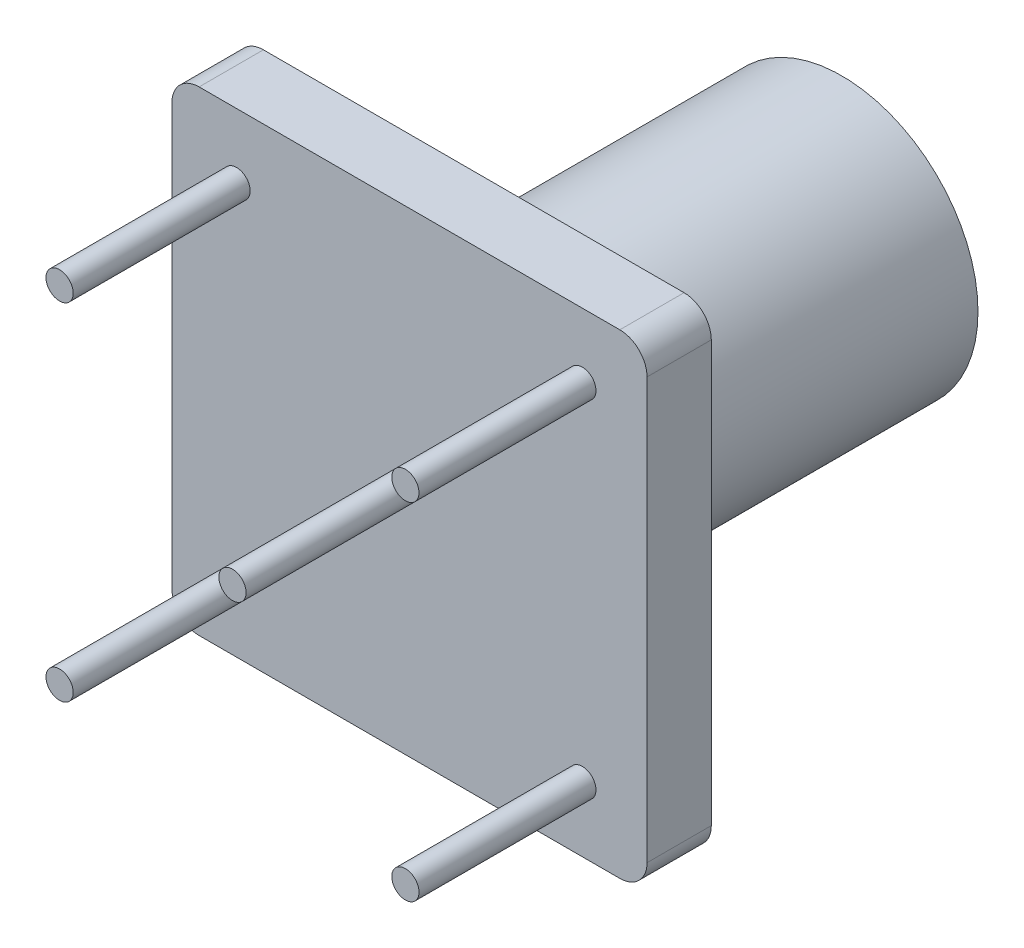
ISO-10303-21;
HEADER;
FILE_DESCRIPTION(('STEP AP214'),'2;1');
FILE_NAME('part.step','',(''),(''),'','','');
FILE_SCHEMA(('AUTOMOTIVE_DESIGN { 1 0 10303 214 1 1 1 1 }'));
ENDSEC;
DATA;
#1=APPLICATION_CONTEXT('core data for automotive mechanical design processes');
#2=APPLICATION_PROTOCOL_DEFINITION('international standard','automotive_design',2000,#1);
#3=PRODUCT_CONTEXT('',#1,'mechanical');
#4=PRODUCT('Part','Part','',(#3));
#5=PRODUCT_RELATED_PRODUCT_CATEGORY('part','',(#4));
#6=PRODUCT_DEFINITION_FORMATION('','',#4);
#7=PRODUCT_DEFINITION_CONTEXT('part definition',#1,'design');
#8=PRODUCT_DEFINITION('design','',#6,#7);
#9=PRODUCT_DEFINITION_SHAPE('','',#8);
#10=(LENGTH_UNIT() NAMED_UNIT(*) SI_UNIT(.MILLI.,.METRE.));
#11=(NAMED_UNIT(*) PLANE_ANGLE_UNIT() SI_UNIT($,.RADIAN.));
#12=(NAMED_UNIT(*) SI_UNIT($,.STERADIAN.) SOLID_ANGLE_UNIT());
#13=UNCERTAINTY_MEASURE_WITH_UNIT(LENGTH_MEASURE(1.E-05),#10,'distance_accuracy_value','');
#14=(GEOMETRIC_REPRESENTATION_CONTEXT(3) GLOBAL_UNCERTAINTY_ASSIGNED_CONTEXT((#13)) GLOBAL_UNIT_ASSIGNED_CONTEXT((#10,
#11,#12)) REPRESENTATION_CONTEXT('',''));
#15=CARTESIAN_POINT('',(0.,0.,0.));
#16=DIRECTION('',(0.,0.,1.));
#17=DIRECTION('',(1.,0.,0.));
#18=AXIS2_PLACEMENT_3D('',#15,#16,#17);
#19=CARTESIAN_POINT('',(8.725,-8.725,0.));
#20=DIRECTION('',(0.,0.,-1.));
#21=DIRECTION('',(-1.,0.,0.));
#22=AXIS2_PLACEMENT_3D('',#19,#20,#21);
#23=PLANE('',#22);
#24=CARTESIAN_POINT('',(8.725,-8.725,0.));
#25=DIRECTION('',(0.,0.,-1.));
#26=DIRECTION('',(-1.,0.,0.));
#27=AXIS2_PLACEMENT_3D('',#24,#25,#26);
#28=CIRCLE('',#27,4.5);
#29=CARTESIAN_POINT('',(4.225,-8.725,0.));
#30=VERTEX_POINT('',#29);
#31=EDGE_CURVE('E118',#30,#30,#28,.T.);
#32=ORIENTED_EDGE('',*,*,#31,.T.);
#33=EDGE_LOOP('',(#32));
#34=FACE_BOUND('',#33,.T.);
#35=CARTESIAN_POINT('',(8.725,-8.725,0.));
#36=DIRECTION('',(0.,0.,-1.));
#37=DIRECTION('',(-1.,0.,0.));
#38=AXIS2_PLACEMENT_3D('',#35,#36,#37);
#39=CIRCLE('',#38,0.500000000000001);
#40=CARTESIAN_POINT('',(8.225,-8.725,0.));
#41=VERTEX_POINT('',#40);
#42=EDGE_CURVE('E405',#41,#41,#39,.T.);
#43=ORIENTED_EDGE('',*,*,#42,.F.);
#44=EDGE_LOOP('',(#43));
#45=FACE_BOUND('',#44,.T.);
#46=ADVANCED_FACE('F29',(#34,#45),#23,.T.);
#47=CARTESIAN_POINT('',(16.45,-1.,2.36));
#48=DIRECTION('',(0.,0.,1.));
#49=DIRECTION('',(1.,0.,0.));
#50=AXIS2_PLACEMENT_3D('',#47,#48,#49);
#51=PLANE('',#50);
#52=CARTESIAN_POINT('',(2.375,-15.075,2.36));
#53=DIRECTION('',(0.,0.,1.));
#54=DIRECTION('',(1.,0.,0.));
#55=AXIS2_PLACEMENT_3D('',#52,#53,#54);
#56=CIRCLE('',#55,0.5);
#57=CARTESIAN_POINT('',(2.875,-15.075,2.36));
#58=VERTEX_POINT('',#57);
#59=EDGE_CURVE('E415',#58,#58,#56,.T.);
#60=ORIENTED_EDGE('',*,*,#59,.F.);
#61=EDGE_LOOP('',(#60));
#62=FACE_BOUND('',#61,.T.);
#63=CARTESIAN_POINT('',(15.075,-2.375,2.36));
#64=DIRECTION('',(0.,0.,1.));
#65=DIRECTION('',(1.,0.,0.));
#66=AXIS2_PLACEMENT_3D('',#63,#64,#65);
#67=CIRCLE('',#66,0.499999999999997);
#68=CARTESIAN_POINT('',(15.575,-2.375,2.36));
#69=VERTEX_POINT('',#68);
#70=EDGE_CURVE('E427',#69,#69,#67,.T.);
#71=ORIENTED_EDGE('',*,*,#70,.F.);
#72=EDGE_LOOP('',(#71));
#73=FACE_BOUND('',#72,.T.);
#74=CARTESIAN_POINT('',(16.45,-1.,2.36));
#75=DIRECTION('',(0.,0.,1.));
#76=DIRECTION('',(1.,0.,0.));
#77=AXIS2_PLACEMENT_3D('',#74,#75,#76);
#78=CIRCLE('',#77,1.);
#79=CARTESIAN_POINT('',(17.45,-1.00000000000001,2.36));
#80=VERTEX_POINT('',#79);
#81=CARTESIAN_POINT('',(16.45,0.,2.36));
#82=VERTEX_POINT('',#81);
#83=EDGE_CURVE('E133',#80,#82,#78,.T.);
#84=ORIENTED_EDGE('',*,*,#83,.T.);
#85=DIRECTION('',(-1.,0.,0.));
#86=VECTOR('',#85,1.);
#87=CARTESIAN_POINT('',(1.00000000000001,0.,2.36));
#88=LINE('',#87,#86);
#89=CARTESIAN_POINT('',(1.00000000000001,0.,2.36));
#90=VERTEX_POINT('',#89);
#91=EDGE_CURVE('E109',#82,#90,#88,.T.);
#92=ORIENTED_EDGE('',*,*,#91,.T.);
#93=CARTESIAN_POINT('',(1.,-1.,2.36));
#94=DIRECTION('',(0.,0.,1.));
#95=DIRECTION('',(1.,0.,0.));
#96=AXIS2_PLACEMENT_3D('',#93,#94,#95);
#97=CIRCLE('',#96,1.);
#98=CARTESIAN_POINT('',(0.,-1.00000000000001,2.36));
#99=VERTEX_POINT('',#98);
#100=EDGE_CURVE('E136',#90,#99,#97,.T.);
#101=ORIENTED_EDGE('',*,*,#100,.T.);
#102=DIRECTION('',(0.,-1.,0.));
#103=VECTOR('',#102,1.);
#104=CARTESIAN_POINT('',(0.,-1.00000000000001,2.36));
#105=LINE('',#104,#103);
#106=CARTESIAN_POINT('',(0.,-16.45,2.36));
#107=VERTEX_POINT('',#106);
#108=EDGE_CURVE('E138',#99,#107,#105,.T.);
#109=ORIENTED_EDGE('',*,*,#108,.T.);
#110=CARTESIAN_POINT('',(1.,-16.45,2.36));
#111=DIRECTION('',(0.,0.,1.));
#112=DIRECTION('',(1.,0.,0.));
#113=AXIS2_PLACEMENT_3D('',#110,#111,#112);
#114=CIRCLE('',#113,1.);
#115=CARTESIAN_POINT('',(1.00000000000001,-17.45,2.36));
#116=VERTEX_POINT('',#115);
#117=EDGE_CURVE('E140',#107,#116,#114,.T.);
#118=ORIENTED_EDGE('',*,*,#117,.T.);
#119=DIRECTION('',(1.,0.,0.));
#120=VECTOR('',#119,1.);
#121=CARTESIAN_POINT('',(1.00000000000001,-17.45,2.36));
#122=LINE('',#121,#120);
#123=CARTESIAN_POINT('',(16.45,-17.45,2.36));
#124=VERTEX_POINT('',#123);
#125=EDGE_CURVE('E142',#116,#124,#122,.T.);
#126=ORIENTED_EDGE('',*,*,#125,.T.);
#127=CARTESIAN_POINT('',(16.45,-16.45,2.36));
#128=DIRECTION('',(0.,0.,1.));
#129=DIRECTION('',(1.,0.,0.));
#130=AXIS2_PLACEMENT_3D('',#127,#128,#129);
#131=CIRCLE('',#130,1.);
#132=CARTESIAN_POINT('',(17.45,-16.45,2.36));
#133=VERTEX_POINT('',#132);
#134=EDGE_CURVE('E49',#124,#133,#131,.T.);
#135=ORIENTED_EDGE('',*,*,#134,.T.);
#136=DIRECTION('',(0.,1.,0.));
#137=VECTOR('',#136,1.);
#138=CARTESIAN_POINT('',(17.45,-1.00000000000001,2.36));
#139=LINE('',#138,#137);
#140=EDGE_CURVE('E44',#133,#80,#139,.T.);
#141=ORIENTED_EDGE('',*,*,#140,.T.);
#142=EDGE_LOOP('',(#84,#92,#101,#109,#118,#126,#135,#141));
#143=FACE_BOUND('',#142,.T.);
#144=CARTESIAN_POINT('',(8.725,-8.725,2.36));
#145=DIRECTION('',(0.,0.,1.));
#146=DIRECTION('',(1.,0.,0.));
#147=AXIS2_PLACEMENT_3D('',#144,#145,#146);
#148=CIRCLE('',#147,0.500000000000001);
#149=CARTESIAN_POINT('',(9.225,-8.725,2.36));
#150=VERTEX_POINT('',#149);
#151=EDGE_CURVE('E433',#150,#150,#148,.T.);
#152=ORIENTED_EDGE('',*,*,#151,.F.);
#153=EDGE_LOOP('',(#152));
#154=FACE_BOUND('',#153,.T.);
#155=CARTESIAN_POINT('',(2.375,-2.375,2.36));
#156=DIRECTION('',(0.,0.,1.));
#157=DIRECTION('',(1.,0.,0.));
#158=AXIS2_PLACEMENT_3D('',#155,#156,#157);
#159=CIRCLE('',#158,0.5);
#160=CARTESIAN_POINT('',(2.875,-2.375,2.36));
#161=VERTEX_POINT('',#160);
#162=EDGE_CURVE('E421',#161,#161,#159,.T.);
#163=ORIENTED_EDGE('',*,*,#162,.F.);
#164=EDGE_LOOP('',(#163));
#165=FACE_BOUND('',#164,.T.);
#166=CARTESIAN_POINT('',(15.075,-15.075,2.36));
#167=DIRECTION('',(0.,0.,1.));
#168=DIRECTION('',(1.,0.,0.));
#169=AXIS2_PLACEMENT_3D('',#166,#167,#168);
#170=CIRCLE('',#169,0.499999999999999);
#171=CARTESIAN_POINT('',(15.575,-15.075,2.36));
#172=VERTEX_POINT('',#171);
#173=EDGE_CURVE('E404',#172,#172,#170,.T.);
#174=ORIENTED_EDGE('',*,*,#173,.F.);
#175=EDGE_LOOP('',(#174));
#176=FACE_BOUND('',#175,.T.);
#177=ADVANCED_FACE('F167',(#62,#73,#143,#154,#165,#176),#51,.T.);
#178=CARTESIAN_POINT('',(16.45,-1.,0.));
#179=DIRECTION('',(0.,0.,1.));
#180=DIRECTION('',(1.,0.,0.));
#181=AXIS2_PLACEMENT_3D('',#178,#179,#180);
#182=PLANE('',#181);
#183=CARTESIAN_POINT('',(16.45,-1.,0.));
#184=DIRECTION('',(0.,0.,1.));
#185=DIRECTION('',(1.,0.,0.));
#186=AXIS2_PLACEMENT_3D('',#183,#184,#185);
#187=CIRCLE('',#186,1.);
#188=CARTESIAN_POINT('',(17.45,-1.00000000000001,0.));
#189=VERTEX_POINT('',#188);
#190=CARTESIAN_POINT('',(16.45,0.,0.));
#191=VERTEX_POINT('',#190);
#192=EDGE_CURVE('E100',#189,#191,#187,.T.);
#193=ORIENTED_EDGE('',*,*,#192,.F.);
#194=DIRECTION('',(0.,1.,0.));
#195=VECTOR('',#194,1.);
#196=CARTESIAN_POINT('',(17.45,-1.00000000000001,0.));
#197=LINE('',#196,#195);
#198=CARTESIAN_POINT('',(17.45,-16.45,0.));
#199=VERTEX_POINT('',#198);
#200=EDGE_CURVE('E131',#199,#189,#197,.T.);
#201=ORIENTED_EDGE('',*,*,#200,.F.);
#202=CARTESIAN_POINT('',(16.45,-16.45,0.));
#203=DIRECTION('',(0.,0.,1.));
#204=DIRECTION('',(1.,0.,0.));
#205=AXIS2_PLACEMENT_3D('',#202,#203,#204);
#206=CIRCLE('',#205,1.);
#207=CARTESIAN_POINT('',(16.45,-17.45,0.));
#208=VERTEX_POINT('',#207);
#209=EDGE_CURVE('E129',#208,#199,#206,.T.);
#210=ORIENTED_EDGE('',*,*,#209,.F.);
#211=DIRECTION('',(1.,0.,0.));
#212=VECTOR('',#211,1.);
#213=CARTESIAN_POINT('',(1.00000000000001,-17.45,0.));
#214=LINE('',#213,#212);
#215=CARTESIAN_POINT('',(1.00000000000001,-17.45,0.));
#216=VERTEX_POINT('',#215);
#217=EDGE_CURVE('E127',#216,#208,#214,.T.);
#218=ORIENTED_EDGE('',*,*,#217,.F.);
#219=CARTESIAN_POINT('',(1.,-16.45,0.));
#220=DIRECTION('',(0.,0.,1.));
#221=DIRECTION('',(1.,0.,0.));
#222=AXIS2_PLACEMENT_3D('',#219,#220,#221);
#223=CIRCLE('',#222,1.);
#224=CARTESIAN_POINT('',(0.,-16.45,0.));
#225=VERTEX_POINT('',#224);
#226=EDGE_CURVE('E125',#225,#216,#223,.T.);
#227=ORIENTED_EDGE('',*,*,#226,.F.);
#228=DIRECTION('',(0.,-1.,0.));
#229=VECTOR('',#228,1.);
#230=CARTESIAN_POINT('',(0.,-1.00000000000001,0.));
#231=LINE('',#230,#229);
#232=CARTESIAN_POINT('',(0.,-1.00000000000001,0.));
#233=VERTEX_POINT('',#232);
#234=EDGE_CURVE('E123',#233,#225,#231,.T.);
#235=ORIENTED_EDGE('',*,*,#234,.F.);
#236=CARTESIAN_POINT('',(1.,-1.,0.));
#237=DIRECTION('',(0.,0.,1.));
#238=DIRECTION('',(1.,0.,0.));
#239=AXIS2_PLACEMENT_3D('',#236,#237,#238);
#240=CIRCLE('',#239,1.);
#241=CARTESIAN_POINT('',(1.00000000000001,0.,0.));
#242=VERTEX_POINT('',#241);
#243=EDGE_CURVE('E102',#242,#233,#240,.T.);
#244=ORIENTED_EDGE('',*,*,#243,.F.);
#245=DIRECTION('',(-1.,0.,0.));
#246=VECTOR('',#245,1.);
#247=CARTESIAN_POINT('',(1.00000000000001,0.,0.));
#248=LINE('',#247,#246);
#249=EDGE_CURVE('E94',#191,#242,#248,.T.);
#250=ORIENTED_EDGE('',*,*,#249,.F.);
#251=EDGE_LOOP('',(#193,#201,#210,#218,#227,#235,#244,#250));
#252=FACE_BOUND('',#251,.T.);
#253=CARTESIAN_POINT('',(8.725,-8.725,0.));
#254=DIRECTION('',(0.,0.,1.));
#255=DIRECTION('',(1.,0.,0.));
#256=AXIS2_PLACEMENT_3D('',#253,#254,#255);
#257=CIRCLE('',#256,5.);
#258=CARTESIAN_POINT('',(13.725,-8.725,0.));
#259=VERTEX_POINT('',#258);
#260=EDGE_CURVE('E11',#259,#259,#257,.F.);
#261=ORIENTED_EDGE('',*,*,#260,.F.);
#262=EDGE_LOOP('',(#261));
#263=FACE_BOUND('',#262,.T.);
#264=ADVANCED_FACE('F96',(#252,#263),#182,.F.);
#265=CARTESIAN_POINT('',(16.45,-1.,2.36));
#266=DIRECTION('',(0.,0.,-1.));
#267=DIRECTION('',(-1.,0.,0.));
#268=AXIS2_PLACEMENT_3D('',#265,#266,#267);
#269=CYLINDRICAL_SURFACE('',#268,1.);
#270=ORIENTED_EDGE('',*,*,#192,.T.);
#271=DIRECTION('',(0.,0.,-1.));
#272=VECTOR('',#271,1.);
#273=CARTESIAN_POINT('',(16.45,0.,2.36));
#274=LINE('',#273,#272);
#275=EDGE_CURVE('E37',#82,#191,#274,.T.);
#276=ORIENTED_EDGE('',*,*,#275,.F.);
#277=ORIENTED_EDGE('',*,*,#83,.F.);
#278=DIRECTION('',(0.,0.,-1.));
#279=VECTOR('',#278,1.);
#280=CARTESIAN_POINT('',(17.45,-1.00000000000001,2.36));
#281=LINE('',#280,#279);
#282=EDGE_CURVE('E114',#80,#189,#281,.T.);
#283=ORIENTED_EDGE('',*,*,#282,.T.);
#284=EDGE_LOOP('',(#270,#276,#277,#283));
#285=FACE_BOUND('',#284,.T.);
#286=ADVANCED_FACE('F31',(#285),#269,.T.);
#287=CARTESIAN_POINT('',(1.00000000000001,0.,2.36));
#288=DIRECTION('',(0.,-1.,0.));
#289=DIRECTION('',(0.,0.,-1.));
#290=AXIS2_PLACEMENT_3D('',#287,#288,#289);
#291=PLANE('',#290);
#292=ORIENTED_EDGE('',*,*,#249,.T.);
#293=DIRECTION('',(0.,0.,-1.));
#294=VECTOR('',#293,1.);
#295=CARTESIAN_POINT('',(1.00000000000001,0.,2.36));
#296=LINE('',#295,#294);
#297=EDGE_CURVE('E112',#90,#242,#296,.T.);
#298=ORIENTED_EDGE('',*,*,#297,.F.);
#299=ORIENTED_EDGE('',*,*,#91,.F.);
#300=ORIENTED_EDGE('',*,*,#275,.T.);
#301=EDGE_LOOP('',(#292,#298,#299,#300));
#302=FACE_BOUND('',#301,.T.);
#303=ADVANCED_FACE('F108',(#302),#291,.F.);
#304=CARTESIAN_POINT('',(1.,-1.,2.36));
#305=DIRECTION('',(0.,0.,-1.));
#306=DIRECTION('',(-1.,0.,0.));
#307=AXIS2_PLACEMENT_3D('',#304,#305,#306);
#308=CYLINDRICAL_SURFACE('',#307,1.);
#309=ORIENTED_EDGE('',*,*,#243,.T.);
#310=DIRECTION('',(0.,0.,-1.));
#311=VECTOR('',#310,1.);
#312=CARTESIAN_POINT('',(0.,-1.00000000000001,2.36));
#313=LINE('',#312,#311);
#314=EDGE_CURVE('E159',#99,#233,#313,.T.);
#315=ORIENTED_EDGE('',*,*,#314,.F.);
#316=ORIENTED_EDGE('',*,*,#100,.F.);
#317=ORIENTED_EDGE('',*,*,#297,.T.);
#318=EDGE_LOOP('',(#309,#315,#316,#317));
#319=FACE_BOUND('',#318,.T.);
#320=ADVANCED_FACE('F164',(#319),#308,.T.);
#321=CARTESIAN_POINT('',(0.,-1.00000000000001,2.36));
#322=DIRECTION('',(1.,0.,0.));
#323=DIRECTION('',(0.,1.,0.));
#324=AXIS2_PLACEMENT_3D('',#321,#322,#323);
#325=PLANE('',#324);
#326=ORIENTED_EDGE('',*,*,#234,.T.);
#327=DIRECTION('',(0.,0.,-1.));
#328=VECTOR('',#327,1.);
#329=CARTESIAN_POINT('',(0.,-16.45,2.36));
#330=LINE('',#329,#328);
#331=EDGE_CURVE('E156',#107,#225,#330,.T.);
#332=ORIENTED_EDGE('',*,*,#331,.F.);
#333=ORIENTED_EDGE('',*,*,#108,.F.);
#334=ORIENTED_EDGE('',*,*,#314,.T.);
#335=EDGE_LOOP('',(#326,#332,#333,#334));
#336=FACE_BOUND('',#335,.T.);
#337=ADVANCED_FACE('F173',(#336),#325,.F.);
#338=CARTESIAN_POINT('',(1.,-16.45,2.36));
#339=DIRECTION('',(0.,0.,-1.));
#340=DIRECTION('',(-1.,0.,0.));
#341=AXIS2_PLACEMENT_3D('',#338,#339,#340);
#342=CYLINDRICAL_SURFACE('',#341,1.);
#343=ORIENTED_EDGE('',*,*,#226,.T.);
#344=DIRECTION('',(0.,0.,-1.));
#345=VECTOR('',#344,1.);
#346=CARTESIAN_POINT('',(1.00000000000001,-17.45,2.36));
#347=LINE('',#346,#345);
#348=EDGE_CURVE('E153',#116,#216,#347,.T.);
#349=ORIENTED_EDGE('',*,*,#348,.F.);
#350=ORIENTED_EDGE('',*,*,#117,.F.);
#351=ORIENTED_EDGE('',*,*,#331,.T.);
#352=EDGE_LOOP('',(#343,#349,#350,#351));
#353=FACE_BOUND('',#352,.T.);
#354=ADVANCED_FACE('F176',(#353),#342,.T.);
#355=CARTESIAN_POINT('',(1.00000000000001,-17.45,2.36));
#356=DIRECTION('',(0.,1.,0.));
#357=DIRECTION('',(0.,0.,1.));
#358=AXIS2_PLACEMENT_3D('',#355,#356,#357);
#359=PLANE('',#358);
#360=ORIENTED_EDGE('',*,*,#217,.T.);
#361=DIRECTION('',(0.,0.,-1.));
#362=VECTOR('',#361,1.);
#363=CARTESIAN_POINT('',(16.45,-17.45,2.36));
#364=LINE('',#363,#362);
#365=EDGE_CURVE('E150',#124,#208,#364,.T.);
#366=ORIENTED_EDGE('',*,*,#365,.F.);
#367=ORIENTED_EDGE('',*,*,#125,.F.);
#368=ORIENTED_EDGE('',*,*,#348,.T.);
#369=EDGE_LOOP('',(#360,#366,#367,#368));
#370=FACE_BOUND('',#369,.T.);
#371=ADVANCED_FACE('F181',(#370),#359,.F.);
#372=CARTESIAN_POINT('',(16.45,-16.45,2.36));
#373=DIRECTION('',(0.,0.,-1.));
#374=DIRECTION('',(-1.,0.,0.));
#375=AXIS2_PLACEMENT_3D('',#372,#373,#374);
#376=CYLINDRICAL_SURFACE('',#375,1.);
#377=ORIENTED_EDGE('',*,*,#209,.T.);
#378=DIRECTION('',(0.,0.,-1.));
#379=VECTOR('',#378,1.);
#380=CARTESIAN_POINT('',(17.45,-16.45,2.36));
#381=LINE('',#380,#379);
#382=EDGE_CURVE('E147',#133,#199,#381,.T.);
#383=ORIENTED_EDGE('',*,*,#382,.F.);
#384=ORIENTED_EDGE('',*,*,#134,.F.);
#385=ORIENTED_EDGE('',*,*,#365,.T.);
#386=EDGE_LOOP('',(#377,#383,#384,#385));
#387=FACE_BOUND('',#386,.T.);
#388=ADVANCED_FACE('F184',(#387),#376,.T.);
#389=CARTESIAN_POINT('',(17.45,-1.00000000000001,2.36));
#390=DIRECTION('',(-1.,0.,0.));
#391=DIRECTION('',(0.,-1.,0.));
#392=AXIS2_PLACEMENT_3D('',#389,#390,#391);
#393=PLANE('',#392);
#394=ORIENTED_EDGE('',*,*,#200,.T.);
#395=ORIENTED_EDGE('',*,*,#282,.F.);
#396=ORIENTED_EDGE('',*,*,#140,.F.);
#397=ORIENTED_EDGE('',*,*,#382,.T.);
#398=EDGE_LOOP('',(#394,#395,#396,#397));
#399=FACE_BOUND('',#398,.T.);
#400=ADVANCED_FACE('F186',(#399),#393,.F.);
#401=CARTESIAN_POINT('',(8.725,-8.725,-13.52));
#402=DIRECTION('',(0.,0.,1.));
#403=DIRECTION('',(1.,0.,0.));
#404=AXIS2_PLACEMENT_3D('',#401,#402,#403);
#405=CYLINDRICAL_SURFACE('',#404,5.);
#406=CARTESIAN_POINT('',(8.725,-8.725,-13.52));
#407=DIRECTION('',(0.,0.,-1.));
#408=DIRECTION('',(-1.,0.,0.));
#409=AXIS2_PLACEMENT_3D('',#406,#407,#408);
#410=CIRCLE('',#409,5.);
#411=CARTESIAN_POINT('',(3.725,-8.725,-13.52));
#412=VERTEX_POINT('',#411);
#413=EDGE_CURVE('E115',#412,#412,#410,.T.);
#414=ORIENTED_EDGE('',*,*,#413,.F.);
#415=EDGE_LOOP('',(#414));
#416=FACE_BOUND('',#415,.T.);
#417=ORIENTED_EDGE('',*,*,#260,.T.);
#418=EDGE_LOOP('',(#417));
#419=FACE_BOUND('',#418,.T.);
#420=ADVANCED_FACE('F188',(#416,#419),#405,.T.);
#421=CARTESIAN_POINT('',(8.725,-8.725,-13.52));
#422=DIRECTION('',(0.,0.,-1.));
#423=DIRECTION('',(-1.,0.,0.));
#424=AXIS2_PLACEMENT_3D('',#421,#422,#423);
#425=PLANE('',#424);
#426=CARTESIAN_POINT('',(8.725,-8.725,-13.52));
#427=DIRECTION('',(0.,0.,-1.));
#428=DIRECTION('',(-1.,0.,0.));
#429=AXIS2_PLACEMENT_3D('',#426,#427,#428);
#430=CIRCLE('',#429,4.5);
#431=CARTESIAN_POINT('',(4.225,-8.725,-13.52));
#432=VERTEX_POINT('',#431);
#433=EDGE_CURVE('E439',#432,#432,#430,.T.);
#434=ORIENTED_EDGE('',*,*,#433,.F.);
#435=EDGE_LOOP('',(#434));
#436=FACE_BOUND('',#435,.T.);
#437=ORIENTED_EDGE('',*,*,#413,.T.);
#438=EDGE_LOOP('',(#437));
#439=FACE_BOUND('',#438,.T.);
#440=ADVANCED_FACE('F194',(#436,#439),#425,.T.);
#441=CARTESIAN_POINT('',(8.725,-8.725,0.));
#442=DIRECTION('',(0.,0.,-1.));
#443=DIRECTION('',(-1.,0.,0.));
#444=AXIS2_PLACEMENT_3D('',#441,#442,#443);
#445=CYLINDRICAL_SURFACE('',#444,4.5);
#446=ORIENTED_EDGE('',*,*,#31,.F.);
#447=EDGE_LOOP('',(#446));
#448=FACE_BOUND('',#447,.T.);
#449=ORIENTED_EDGE('',*,*,#433,.T.);
#450=EDGE_LOOP('',(#449));
#451=FACE_BOUND('',#450,.T.);
#452=ADVANCED_FACE('F212',(#448,#451),#445,.F.);
#453=CARTESIAN_POINT('',(8.725,-8.725,8.86));
#454=DIRECTION('',(0.,0.,-1.));
#455=DIRECTION('',(-1.,0.,0.));
#456=AXIS2_PLACEMENT_3D('',#453,#454,#455);
#457=CYLINDRICAL_SURFACE('',#456,0.500000000000001);
#458=CARTESIAN_POINT('',(8.725,-8.725,8.86));
#459=DIRECTION('',(0.,0.,1.));
#460=DIRECTION('',(1.,0.,0.));
#461=AXIS2_PLACEMENT_3D('',#458,#459,#460);
#462=CIRCLE('',#461,0.500000000000001);
#463=CARTESIAN_POINT('',(9.225,-8.725,8.86));
#464=VERTEX_POINT('',#463);
#465=EDGE_CURVE('E436',#464,#464,#462,.T.);
#466=ORIENTED_EDGE('',*,*,#465,.F.);
#467=EDGE_LOOP('',(#466));
#468=FACE_BOUND('',#467,.T.);
#469=ORIENTED_EDGE('',*,*,#151,.T.);
#470=EDGE_LOOP('',(#469));
#471=FACE_BOUND('',#470,.T.);
#472=ADVANCED_FACE('F210',(#468,#471),#457,.T.);
#473=CARTESIAN_POINT('',(8.725,-8.725,8.86));
#474=DIRECTION('',(0.,0.,1.));
#475=DIRECTION('',(1.,0.,0.));
#476=AXIS2_PLACEMENT_3D('',#473,#474,#475);
#477=PLANE('',#476);
#478=ORIENTED_EDGE('',*,*,#465,.T.);
#479=EDGE_LOOP('',(#478));
#480=FACE_BOUND('',#479,.T.);
#481=ADVANCED_FACE('F285',(#480),#477,.T.);
#482=CARTESIAN_POINT('',(15.075,-2.375,8.86));
#483=DIRECTION('',(0.,0.,-1.));
#484=DIRECTION('',(-1.,0.,0.));
#485=AXIS2_PLACEMENT_3D('',#482,#483,#484);
#486=CYLINDRICAL_SURFACE('',#485,0.499999999999997);
#487=CARTESIAN_POINT('',(15.075,-2.375,8.86));
#488=DIRECTION('',(0.,0.,1.));
#489=DIRECTION('',(1.,0.,0.));
#490=AXIS2_PLACEMENT_3D('',#487,#488,#489);
#491=CIRCLE('',#490,0.499999999999997);
#492=CARTESIAN_POINT('',(15.575,-2.375,8.86));
#493=VERTEX_POINT('',#492);
#494=EDGE_CURVE('E430',#493,#493,#491,.T.);
#495=ORIENTED_EDGE('',*,*,#494,.F.);
#496=EDGE_LOOP('',(#495));
#497=FACE_BOUND('',#496,.T.);
#498=ORIENTED_EDGE('',*,*,#70,.T.);
#499=EDGE_LOOP('',(#498));
#500=FACE_BOUND('',#499,.T.);
#501=ADVANCED_FACE('F294',(#497,#500),#486,.T.);
#502=CARTESIAN_POINT('',(15.075,-2.375,8.86));
#503=DIRECTION('',(0.,0.,1.));
#504=DIRECTION('',(1.,0.,0.));
#505=AXIS2_PLACEMENT_3D('',#502,#503,#504);
#506=PLANE('',#505);
#507=ORIENTED_EDGE('',*,*,#494,.T.);
#508=EDGE_LOOP('',(#507));
#509=FACE_BOUND('',#508,.T.);
#510=ADVANCED_FACE('F303',(#509),#506,.T.);
#511=CARTESIAN_POINT('',(2.375,-2.375,8.86));
#512=DIRECTION('',(0.,0.,-1.));
#513=DIRECTION('',(-1.,0.,0.));
#514=AXIS2_PLACEMENT_3D('',#511,#512,#513);
#515=CYLINDRICAL_SURFACE('',#514,0.5);
#516=CARTESIAN_POINT('',(2.375,-2.375,8.86));
#517=DIRECTION('',(0.,0.,1.));
#518=DIRECTION('',(1.,0.,0.));
#519=AXIS2_PLACEMENT_3D('',#516,#517,#518);
#520=CIRCLE('',#519,0.5);
#521=CARTESIAN_POINT('',(2.875,-2.375,8.86));
#522=VERTEX_POINT('',#521);
#523=EDGE_CURVE('E424',#522,#522,#520,.T.);
#524=ORIENTED_EDGE('',*,*,#523,.F.);
#525=EDGE_LOOP('',(#524));
#526=FACE_BOUND('',#525,.T.);
#527=ORIENTED_EDGE('',*,*,#162,.T.);
#528=EDGE_LOOP('',(#527));
#529=FACE_BOUND('',#528,.T.);
#530=ADVANCED_FACE('F313',(#526,#529),#515,.T.);
#531=CARTESIAN_POINT('',(2.375,-2.375,8.86));
#532=DIRECTION('',(0.,0.,1.));
#533=DIRECTION('',(1.,0.,0.));
#534=AXIS2_PLACEMENT_3D('',#531,#532,#533);
#535=PLANE('',#534);
#536=ORIENTED_EDGE('',*,*,#523,.T.);
#537=EDGE_LOOP('',(#536));
#538=FACE_BOUND('',#537,.T.);
#539=ADVANCED_FACE('F323',(#538),#535,.T.);
#540=CARTESIAN_POINT('',(2.375,-15.075,8.86));
#541=DIRECTION('',(0.,0.,-1.));
#542=DIRECTION('',(-1.,0.,0.));
#543=AXIS2_PLACEMENT_3D('',#540,#541,#542);
#544=CYLINDRICAL_SURFACE('',#543,0.5);
#545=CARTESIAN_POINT('',(2.375,-15.075,8.86));
#546=DIRECTION('',(0.,0.,1.));
#547=DIRECTION('',(1.,0.,0.));
#548=AXIS2_PLACEMENT_3D('',#545,#546,#547);
#549=CIRCLE('',#548,0.5);
#550=CARTESIAN_POINT('',(2.875,-15.075,8.86));
#551=VERTEX_POINT('',#550);
#552=EDGE_CURVE('E418',#551,#551,#549,.T.);
#553=ORIENTED_EDGE('',*,*,#552,.F.);
#554=EDGE_LOOP('',(#553));
#555=FACE_BOUND('',#554,.T.);
#556=ORIENTED_EDGE('',*,*,#59,.T.);
#557=EDGE_LOOP('',(#556));
#558=FACE_BOUND('',#557,.T.);
#559=ADVANCED_FACE('F333',(#555,#558),#544,.T.);
#560=CARTESIAN_POINT('',(2.375,-15.075,8.86));
#561=DIRECTION('',(0.,0.,1.));
#562=DIRECTION('',(1.,0.,0.));
#563=AXIS2_PLACEMENT_3D('',#560,#561,#562);
#564=PLANE('',#563);
#565=ORIENTED_EDGE('',*,*,#552,.T.);
#566=EDGE_LOOP('',(#565));
#567=FACE_BOUND('',#566,.T.);
#568=ADVANCED_FACE('F343',(#567),#564,.T.);
#569=CARTESIAN_POINT('',(15.075,-15.075,8.86));
#570=DIRECTION('',(0.,0.,-1.));
#571=DIRECTION('',(-1.,0.,0.));
#572=AXIS2_PLACEMENT_3D('',#569,#570,#571);
#573=CYLINDRICAL_SURFACE('',#572,0.499999999999999);
#574=CARTESIAN_POINT('',(15.075,-15.075,8.86));
#575=DIRECTION('',(0.,0.,1.));
#576=DIRECTION('',(1.,0.,0.));
#577=AXIS2_PLACEMENT_3D('',#574,#575,#576);
#578=CIRCLE('',#577,0.499999999999999);
#579=CARTESIAN_POINT('',(15.575,-15.075,8.86));
#580=VERTEX_POINT('',#579);
#581=EDGE_CURVE('E408',#580,#580,#578,.T.);
#582=ORIENTED_EDGE('',*,*,#581,.F.);
#583=EDGE_LOOP('',(#582));
#584=FACE_BOUND('',#583,.T.);
#585=ORIENTED_EDGE('',*,*,#173,.T.);
#586=EDGE_LOOP('',(#585));
#587=FACE_BOUND('',#586,.T.);
#588=ADVANCED_FACE('F353',(#584,#587),#573,.T.);
#589=CARTESIAN_POINT('',(15.075,-15.075,8.86));
#590=DIRECTION('',(0.,0.,1.));
#591=DIRECTION('',(1.,0.,0.));
#592=AXIS2_PLACEMENT_3D('',#589,#590,#591);
#593=PLANE('',#592);
#594=ORIENTED_EDGE('',*,*,#581,.T.);
#595=EDGE_LOOP('',(#594));
#596=FACE_BOUND('',#595,.T.);
#597=ADVANCED_FACE('F363',(#596),#593,.T.);
#598=CARTESIAN_POINT('',(8.725,-8.725,-9.));
#599=DIRECTION('',(0.,0.,1.));
#600=DIRECTION('',(1.,0.,0.));
#601=AXIS2_PLACEMENT_3D('',#598,#599,#600);
#602=CYLINDRICAL_SURFACE('',#601,0.500000000000001);
#603=CARTESIAN_POINT('',(8.725,-8.725,-9.));
#604=DIRECTION('',(0.,0.,-1.));
#605=DIRECTION('',(-1.,0.,0.));
#606=AXIS2_PLACEMENT_3D('',#603,#604,#605);
#607=CIRCLE('',#606,0.500000000000001);
#608=CARTESIAN_POINT('',(8.225,-8.725,-9.));
#609=VERTEX_POINT('',#608);
#610=EDGE_CURVE('E403',#609,#609,#607,.T.);
#611=ORIENTED_EDGE('',*,*,#610,.F.);
#612=EDGE_LOOP('',(#611));
#613=FACE_BOUND('',#612,.T.);
#614=ORIENTED_EDGE('',*,*,#42,.T.);
#615=EDGE_LOOP('',(#614));
#616=FACE_BOUND('',#615,.T.);
#617=ADVANCED_FACE('F372',(#613,#616),#602,.T.);
#618=CARTESIAN_POINT('',(8.725,-8.725,-9.));
#619=DIRECTION('',(0.,0.,-1.));
#620=DIRECTION('',(-1.,0.,0.));
#621=AXIS2_PLACEMENT_3D('',#618,#619,#620);
#622=PLANE('',#621);
#623=ORIENTED_EDGE('',*,*,#610,.T.);
#624=EDGE_LOOP('',(#623));
#625=FACE_BOUND('',#624,.T.);
#626=ADVANCED_FACE('F387',(#625),#622,.T.);
#627=CLOSED_SHELL('',(#46,#177,#264,#286,#303,#320,#337,#354,#371,#388,#400,#420,#440,#452,#472,
#481,#501,#510,#530,#539,#559,#568,#588,#597,#617,#626));
#628=MANIFOLD_SOLID_BREP('B2',#627);
#629=ADVANCED_BREP_SHAPE_REPRESENTATION('',(#18,#628),#14);
#630=SHAPE_DEFINITION_REPRESENTATION(#9,#629);
ENDSEC;
END-ISO-10303-21;
